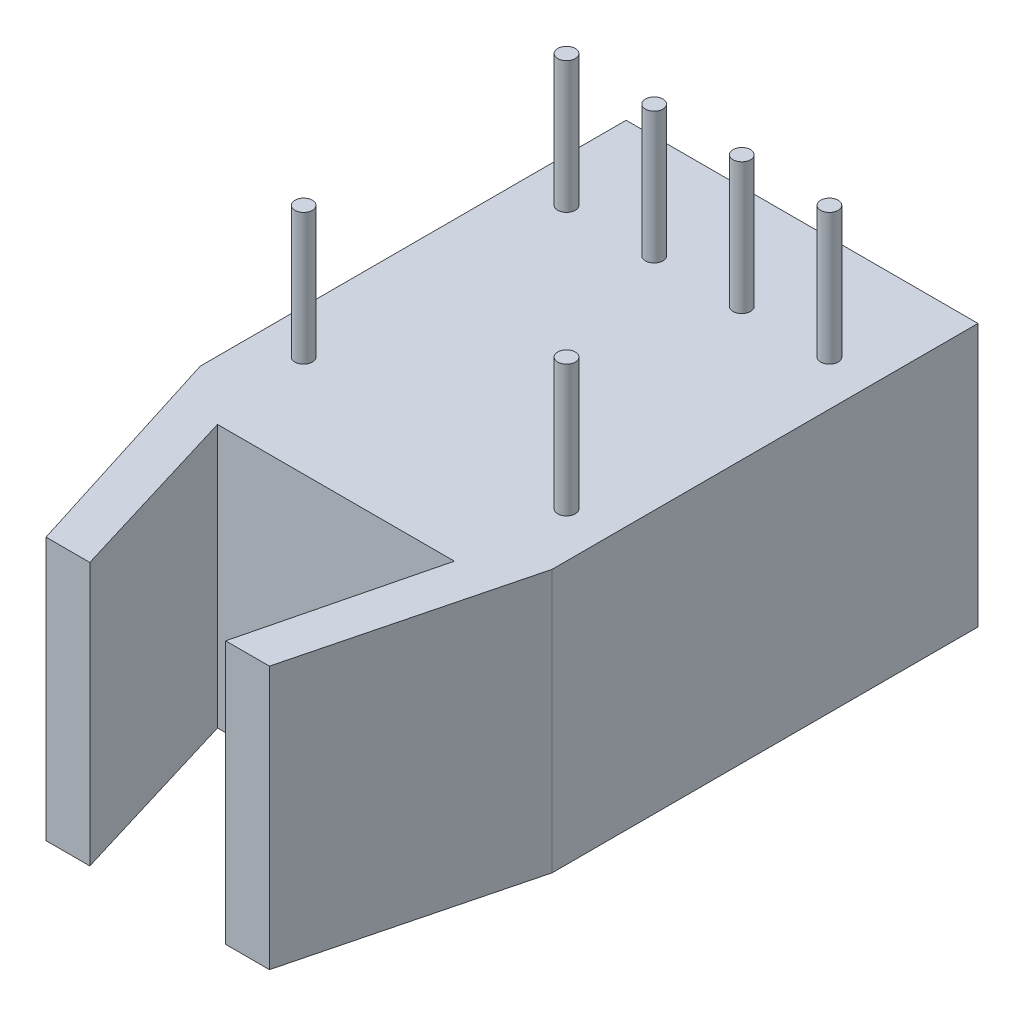
ISO-10303-21;
HEADER;
FILE_DESCRIPTION(('STEP AP214'),'2;1');
FILE_NAME('part.step','',(''),(''),'','','');
FILE_SCHEMA(('AUTOMOTIVE_DESIGN { 1 0 10303 214 1 1 1 1 }'));
ENDSEC;
DATA;
#1=APPLICATION_CONTEXT('core data for automotive mechanical design processes');
#2=APPLICATION_PROTOCOL_DEFINITION('international standard','automotive_design',2000,#1);
#3=PRODUCT_CONTEXT('',#1,'mechanical');
#4=PRODUCT('Part','Part','',(#3));
#5=PRODUCT_RELATED_PRODUCT_CATEGORY('part','',(#4));
#6=PRODUCT_DEFINITION_FORMATION('','',#4);
#7=PRODUCT_DEFINITION_CONTEXT('part definition',#1,'design');
#8=PRODUCT_DEFINITION('design','',#6,#7);
#9=PRODUCT_DEFINITION_SHAPE('','',#8);
#10=(LENGTH_UNIT() NAMED_UNIT(*) SI_UNIT(.MILLI.,.METRE.));
#11=(NAMED_UNIT(*) PLANE_ANGLE_UNIT() SI_UNIT($,.RADIAN.));
#12=(NAMED_UNIT(*) SI_UNIT($,.STERADIAN.) SOLID_ANGLE_UNIT());
#13=UNCERTAINTY_MEASURE_WITH_UNIT(LENGTH_MEASURE(1.E-05),#10,'distance_accuracy_value','');
#14=(GEOMETRIC_REPRESENTATION_CONTEXT(3) GLOBAL_UNCERTAINTY_ASSIGNED_CONTEXT((#13)) GLOBAL_UNIT_ASSIGNED_CONTEXT((#10,
#11,#12)) REPRESENTATION_CONTEXT('',''));
#15=CARTESIAN_POINT('',(0.,0.,0.));
#16=DIRECTION('',(0.,0.,1.));
#17=DIRECTION('',(1.,0.,0.));
#18=AXIS2_PLACEMENT_3D('',#15,#16,#17);
#19=CARTESIAN_POINT('',(0.,7.62,0.));
#20=DIRECTION('',(0.,1.,0.));
#21=DIRECTION('',(0.,0.,1.));
#22=AXIS2_PLACEMENT_3D('',#19,#20,#21);
#23=PLANE('',#22);
#24=CARTESIAN_POINT('',(1.27,7.62,2.9972));
#25=DIRECTION('',(0.,1.,0.));
#26=DIRECTION('',(0.,0.,1.));
#27=AXIS2_PLACEMENT_3D('',#24,#25,#26);
#28=CIRCLE('',#27,0.254);
#29=CARTESIAN_POINT('',(1.27,7.62,3.2512));
#30=VERTEX_POINT('',#29);
#31=EDGE_CURVE('E135',#30,#30,#28,.T.);
#32=ORIENTED_EDGE('',*,*,#31,.F.);
#33=EDGE_LOOP('',(#32));
#34=FACE_BOUND('',#33,.T.);
#35=DIRECTION('',(0.,0.,1.));
#36=VECTOR('',#35,1.);
#37=CARTESIAN_POINT('',(0.,7.62,0.));
#38=LINE('',#37,#36);
#39=CARTESIAN_POINT('',(0.,7.62,0.));
#40=VERTEX_POINT('',#39);
#41=CARTESIAN_POINT('',(0.,7.62,12.3444));
#42=VERTEX_POINT('',#41);
#43=EDGE_CURVE('E130',#40,#42,#38,.T.);
#44=ORIENTED_EDGE('',*,*,#43,.T.);
#45=DIRECTION('',(0.300509046787398,0.,0.953778964330274));
#46=VECTOR('',#45,1.);
#47=CARTESIAN_POINT('',(0.,7.62,12.3444));
#48=LINE('',#47,#46);
#49=CARTESIAN_POINT('',(2.05672700801933,7.62,18.8722));
#50=VERTEX_POINT('',#49);
#51=EDGE_CURVE('E112',#42,#50,#48,.T.);
#52=ORIENTED_EDGE('',*,*,#51,.T.);
#53=DIRECTION('',(1.,0.,0.));
#54=VECTOR('',#53,1.);
#55=CARTESIAN_POINT('',(2.05672700801933,7.62,18.8722));
#56=LINE('',#55,#54);
#57=CARTESIAN_POINT('',(3.32672700801933,7.62,18.8722));
#58=VERTEX_POINT('',#57);
#59=EDGE_CURVE('E122',#50,#58,#56,.T.);
#60=ORIENTED_EDGE('',*,*,#59,.T.);
#61=DIRECTION('',(-0.290411816615932,0.,-0.95690175920511));
#62=VECTOR('',#61,1.);
#63=CARTESIAN_POINT('',(3.32672700801933,7.62,18.8722));
#64=LINE('',#63,#62);
#65=CARTESIAN_POINT('',(1.71375929008197,7.62,13.5575001202891));
#66=VERTEX_POINT('',#65);
#67=EDGE_CURVE('E126',#58,#66,#64,.T.);
#68=ORIENTED_EDGE('',*,*,#67,.T.);
#69=DIRECTION('',(1.,0.,0.));
#70=VECTOR('',#69,1.);
#71=CARTESIAN_POINT('',(1.71375929008197,7.62,13.5575001202891));
#72=LINE('',#71,#70);
#73=CARTESIAN_POINT('',(8.57962491547872,7.62,13.5575001202891));
#74=VERTEX_POINT('',#73);
#75=EDGE_CURVE('E140',#66,#74,#72,.T.);
#76=ORIENTED_EDGE('',*,*,#75,.T.);
#77=DIRECTION('',(-0.240338643663703,0.,0.970689103864822));
#78=VECTOR('',#77,1.);
#79=CARTESIAN_POINT('',(8.57962491547872,7.62,13.5575001202891));
#80=LINE('',#79,#78);
#81=CARTESIAN_POINT('',(7.26372700801933,7.62,18.8722));
#82=VERTEX_POINT('',#81);
#83=EDGE_CURVE('E143',#74,#82,#80,.T.);
#84=ORIENTED_EDGE('',*,*,#83,.T.);
#85=DIRECTION('',(1.,0.,0.));
#86=VECTOR('',#85,1.);
#87=CARTESIAN_POINT('',(7.26372700801933,7.62,18.8722));
#88=LINE('',#87,#86);
#89=CARTESIAN_POINT('',(8.53372700801933,7.62,18.8722));
#90=VERTEX_POINT('',#89);
#91=EDGE_CURVE('E146',#82,#90,#88,.T.);
#92=ORIENTED_EDGE('',*,*,#91,.T.);
#93=DIRECTION('',(0.247327596518511,0.,-0.968931917113053));
#94=VECTOR('',#93,1.);
#95=CARTESIAN_POINT('',(8.53372700801933,7.62,18.8722));
#96=LINE('',#95,#94);
#97=CARTESIAN_POINT('',(10.2,7.62,12.3444));
#98=VERTEX_POINT('',#97);
#99=EDGE_CURVE('E149',#90,#98,#96,.T.);
#100=ORIENTED_EDGE('',*,*,#99,.T.);
#101=DIRECTION('',(0.,0.,-1.));
#102=VECTOR('',#101,1.);
#103=CARTESIAN_POINT('',(10.2,7.62,0.));
#104=LINE('',#103,#102);
#105=CARTESIAN_POINT('',(10.2,7.62,0.));
#106=VERTEX_POINT('',#105);
#107=EDGE_CURVE('E51',#98,#106,#104,.T.);
#108=ORIENTED_EDGE('',*,*,#107,.T.);
#109=DIRECTION('',(-1.,0.,0.));
#110=VECTOR('',#109,1.);
#111=CARTESIAN_POINT('',(0.,7.62,0.));
#112=LINE('',#111,#110);
#113=EDGE_CURVE('E46',#106,#40,#112,.T.);
#114=ORIENTED_EDGE('',*,*,#113,.T.);
#115=EDGE_LOOP('',(#44,#52,#60,#68,#76,#84,#92,#100,#108,#114));
#116=FACE_BOUND('',#115,.T.);
#117=CARTESIAN_POINT('',(3.81,7.62,2.9972));
#118=DIRECTION('',(0.,1.,0.));
#119=DIRECTION('',(0.,0.,1.));
#120=AXIS2_PLACEMENT_3D('',#117,#118,#119);
#121=CIRCLE('',#120,0.254);
#122=CARTESIAN_POINT('',(3.81,7.62,3.2512));
#123=VERTEX_POINT('',#122);
#124=EDGE_CURVE('E475',#123,#123,#121,.T.);
#125=ORIENTED_EDGE('',*,*,#124,.F.);
#126=EDGE_LOOP('',(#125));
#127=FACE_BOUND('',#126,.T.);
#128=CARTESIAN_POINT('',(6.35,7.62,2.9972));
#129=DIRECTION('',(0.,1.,0.));
#130=DIRECTION('',(0.,0.,1.));
#131=AXIS2_PLACEMENT_3D('',#128,#129,#130);
#132=CIRCLE('',#131,0.254);
#133=CARTESIAN_POINT('',(6.35,7.62,3.2512));
#134=VERTEX_POINT('',#133);
#135=EDGE_CURVE('E196',#134,#134,#132,.T.);
#136=ORIENTED_EDGE('',*,*,#135,.F.);
#137=EDGE_LOOP('',(#136));
#138=FACE_BOUND('',#137,.T.);
#139=CARTESIAN_POINT('',(8.89,7.62,2.9972));
#140=DIRECTION('',(0.,1.,0.));
#141=DIRECTION('',(0.,0.,1.));
#142=AXIS2_PLACEMENT_3D('',#139,#140,#141);
#143=CIRCLE('',#142,0.254);
#144=CARTESIAN_POINT('',(8.89,7.62,3.2512));
#145=VERTEX_POINT('',#144);
#146=EDGE_CURVE('E202',#145,#145,#143,.T.);
#147=ORIENTED_EDGE('',*,*,#146,.F.);
#148=EDGE_LOOP('',(#147));
#149=FACE_BOUND('',#148,.T.);
#150=CARTESIAN_POINT('',(1.27,7.62,10.6172));
#151=DIRECTION('',(0.,1.,0.));
#152=DIRECTION('',(0.,0.,1.));
#153=AXIS2_PLACEMENT_3D('',#150,#151,#152);
#154=CIRCLE('',#153,0.254);
#155=CARTESIAN_POINT('',(1.27,7.62,10.8712));
#156=VERTEX_POINT('',#155);
#157=EDGE_CURVE('E208',#156,#156,#154,.T.);
#158=ORIENTED_EDGE('',*,*,#157,.F.);
#159=EDGE_LOOP('',(#158));
#160=FACE_BOUND('',#159,.T.);
#161=CARTESIAN_POINT('',(8.89,7.62,10.6172));
#162=DIRECTION('',(0.,1.,0.));
#163=DIRECTION('',(0.,0.,1.));
#164=AXIS2_PLACEMENT_3D('',#161,#162,#163);
#165=CIRCLE('',#164,0.254);
#166=CARTESIAN_POINT('',(8.89,7.62,10.8712));
#167=VERTEX_POINT('',#166);
#168=EDGE_CURVE('E39',#167,#167,#165,.T.);
#169=ORIENTED_EDGE('',*,*,#168,.F.);
#170=EDGE_LOOP('',(#169));
#171=FACE_BOUND('',#170,.T.);
#172=ADVANCED_FACE('F31',(#34,#116,#127,#138,#149,#160,#171),#23,.T.);
#173=CARTESIAN_POINT('',(0.,7.62,0.));
#174=DIRECTION('',(1.,0.,0.));
#175=DIRECTION('',(0.,0.,-1.));
#176=AXIS2_PLACEMENT_3D('',#173,#174,#175);
#177=PLANE('',#176);
#178=DIRECTION('',(0.,0.,1.));
#179=VECTOR('',#178,1.);
#180=CARTESIAN_POINT('',(0.,0.,0.));
#181=LINE('',#180,#179);
#182=CARTESIAN_POINT('',(0.,0.,0.));
#183=VERTEX_POINT('',#182);
#184=CARTESIAN_POINT('',(0.,0.,12.3444));
#185=VERTEX_POINT('',#184);
#186=EDGE_CURVE('E170',#183,#185,#181,.T.);
#187=ORIENTED_EDGE('',*,*,#186,.T.);
#188=DIRECTION('',(0.,-1.,0.));
#189=VECTOR('',#188,1.);
#190=CARTESIAN_POINT('',(0.,7.62,12.3444));
#191=LINE('',#190,#189);
#192=EDGE_CURVE('E194',#42,#185,#191,.T.);
#193=ORIENTED_EDGE('',*,*,#192,.F.);
#194=ORIENTED_EDGE('',*,*,#43,.F.);
#195=DIRECTION('',(0.,-1.,0.));
#196=VECTOR('',#195,1.);
#197=CARTESIAN_POINT('',(0.,7.62,0.));
#198=LINE('',#197,#196);
#199=EDGE_CURVE('E186',#40,#183,#198,.T.);
#200=ORIENTED_EDGE('',*,*,#199,.T.);
#201=EDGE_LOOP('',(#187,#193,#194,#200));
#202=FACE_BOUND('',#201,.T.);
#203=ADVANCED_FACE('F219',(#202),#177,.F.);
#204=CARTESIAN_POINT('',(10.2,7.62,0.));
#205=DIRECTION('',(-1.,0.,0.));
#206=DIRECTION('',(0.,0.,1.));
#207=AXIS2_PLACEMENT_3D('',#204,#205,#206);
#208=PLANE('',#207);
#209=DIRECTION('',(0.,0.,-1.));
#210=VECTOR('',#209,1.);
#211=CARTESIAN_POINT('',(10.2,0.,0.));
#212=LINE('',#211,#210);
#213=CARTESIAN_POINT('',(10.2,0.,12.3444));
#214=VERTEX_POINT('',#213);
#215=CARTESIAN_POINT('',(10.2,0.,0.));
#216=VERTEX_POINT('',#215);
#217=EDGE_CURVE('E179',#214,#216,#212,.T.);
#218=ORIENTED_EDGE('',*,*,#217,.T.);
#219=DIRECTION('',(0.,-1.,0.));
#220=VECTOR('',#219,1.);
#221=CARTESIAN_POINT('',(10.2,7.62,0.));
#222=LINE('',#221,#220);
#223=EDGE_CURVE('E189',#106,#216,#222,.T.);
#224=ORIENTED_EDGE('',*,*,#223,.F.);
#225=ORIENTED_EDGE('',*,*,#107,.F.);
#226=DIRECTION('',(0.,-1.,0.));
#227=VECTOR('',#226,1.);
#228=CARTESIAN_POINT('',(10.2,7.62,12.3444));
#229=LINE('',#228,#227);
#230=EDGE_CURVE('E192',#98,#214,#229,.T.);
#231=ORIENTED_EDGE('',*,*,#230,.T.);
#232=EDGE_LOOP('',(#218,#224,#225,#231));
#233=FACE_BOUND('',#232,.T.);
#234=ADVANCED_FACE('F225',(#233),#208,.F.);
#235=CARTESIAN_POINT('',(0.,7.62,0.));
#236=DIRECTION('',(0.,0.,1.));
#237=DIRECTION('',(1.,0.,0.));
#238=AXIS2_PLACEMENT_3D('',#235,#236,#237);
#239=PLANE('',#238);
#240=DIRECTION('',(-1.,0.,0.));
#241=VECTOR('',#240,1.);
#242=CARTESIAN_POINT('',(0.,0.,0.));
#243=LINE('',#242,#241);
#244=EDGE_CURVE('E181',#216,#183,#243,.T.);
#245=ORIENTED_EDGE('',*,*,#244,.T.);
#246=ORIENTED_EDGE('',*,*,#199,.F.);
#247=ORIENTED_EDGE('',*,*,#113,.F.);
#248=ORIENTED_EDGE('',*,*,#223,.T.);
#249=EDGE_LOOP('',(#245,#246,#247,#248));
#250=FACE_BOUND('',#249,.T.);
#251=ADVANCED_FACE('F233',(#250),#239,.F.);
#252=CARTESIAN_POINT('',(0.,0.,0.));
#253=DIRECTION('',(0.,1.,0.));
#254=DIRECTION('',(0.,0.,1.));
#255=AXIS2_PLACEMENT_3D('',#252,#253,#254);
#256=PLANE('',#255);
#257=ORIENTED_EDGE('',*,*,#186,.F.);
#258=ORIENTED_EDGE('',*,*,#244,.F.);
#259=ORIENTED_EDGE('',*,*,#217,.F.);
#260=DIRECTION('',(0.247327596518511,0.,-0.968931917113053));
#261=VECTOR('',#260,1.);
#262=CARTESIAN_POINT('',(8.53372700801933,0.,18.8722));
#263=LINE('',#262,#261);
#264=CARTESIAN_POINT('',(8.53372700801933,0.,18.8722));
#265=VERTEX_POINT('',#264);
#266=EDGE_CURVE('E119',#265,#214,#263,.T.);
#267=ORIENTED_EDGE('',*,*,#266,.F.);
#268=DIRECTION('',(1.,0.,0.));
#269=VECTOR('',#268,1.);
#270=CARTESIAN_POINT('',(7.26372700801933,0.,18.8722));
#271=LINE('',#270,#269);
#272=CARTESIAN_POINT('',(7.26372700801933,0.,18.8722));
#273=VERTEX_POINT('',#272);
#274=EDGE_CURVE('E163',#273,#265,#271,.T.);
#275=ORIENTED_EDGE('',*,*,#274,.F.);
#276=DIRECTION('',(-0.240338643663703,0.,0.970689103864822));
#277=VECTOR('',#276,1.);
#278=CARTESIAN_POINT('',(8.57962491547872,0.,13.5575001202891));
#279=LINE('',#278,#277);
#280=CARTESIAN_POINT('',(8.57962491547872,0.,13.5575001202891));
#281=VERTEX_POINT('',#280);
#282=EDGE_CURVE('E160',#281,#273,#279,.T.);
#283=ORIENTED_EDGE('',*,*,#282,.F.);
#284=DIRECTION('',(1.,0.,0.));
#285=VECTOR('',#284,1.);
#286=CARTESIAN_POINT('',(1.71375929008197,0.,13.5575001202891));
#287=LINE('',#286,#285);
#288=CARTESIAN_POINT('',(1.71375929008197,0.,13.5575001202891));
#289=VERTEX_POINT('',#288);
#290=EDGE_CURVE('E157',#289,#281,#287,.T.);
#291=ORIENTED_EDGE('',*,*,#290,.F.);
#292=DIRECTION('',(-0.290411816615932,0.,-0.95690175920511));
#293=VECTOR('',#292,1.);
#294=CARTESIAN_POINT('',(3.32672700801933,0.,18.8722));
#295=LINE('',#294,#293);
#296=CARTESIAN_POINT('',(3.32672700801933,0.,18.8722));
#297=VERTEX_POINT('',#296);
#298=EDGE_CURVE('E154',#297,#289,#295,.T.);
#299=ORIENTED_EDGE('',*,*,#298,.F.);
#300=DIRECTION('',(1.,0.,0.));
#301=VECTOR('',#300,1.);
#302=CARTESIAN_POINT('',(2.05672700801933,0.,18.8722));
#303=LINE('',#302,#301);
#304=CARTESIAN_POINT('',(2.05672700801933,0.,18.8722));
#305=VERTEX_POINT('',#304);
#306=EDGE_CURVE('E152',#305,#297,#303,.T.);
#307=ORIENTED_EDGE('',*,*,#306,.F.);
#308=DIRECTION('',(0.300509046787398,0.,0.953778964330274));
#309=VECTOR('',#308,1.);
#310=CARTESIAN_POINT('',(0.,0.,12.3444));
#311=LINE('',#310,#309);
#312=EDGE_CURVE('E114',#185,#305,#311,.T.);
#313=ORIENTED_EDGE('',*,*,#312,.F.);
#314=EDGE_LOOP('',(#257,#258,#259,#267,#275,#283,#291,#299,#307,#313));
#315=FACE_BOUND('',#314,.T.);
#316=ADVANCED_FACE('F231',(#315),#256,.F.);
#317=CARTESIAN_POINT('',(8.53372700801933,0.,18.8722));
#318=DIRECTION('',(0.968931917113053,0.,0.247327596518511));
#319=DIRECTION('',(0.247327596518511,0.,-0.968931917113053));
#320=AXIS2_PLACEMENT_3D('',#317,#318,#319);
#321=PLANE('',#320);
#322=ORIENTED_EDGE('',*,*,#99,.F.);
#323=DIRECTION('',(0.,1.,0.));
#324=VECTOR('',#323,1.);
#325=CARTESIAN_POINT('',(8.53372700801933,0.,18.8722));
#326=LINE('',#325,#324);
#327=EDGE_CURVE('E168',#265,#90,#326,.T.);
#328=ORIENTED_EDGE('',*,*,#327,.F.);
#329=ORIENTED_EDGE('',*,*,#266,.T.);
#330=ORIENTED_EDGE('',*,*,#230,.F.);
#331=EDGE_LOOP('',(#322,#328,#329,#330));
#332=FACE_BOUND('',#331,.T.);
#333=ADVANCED_FACE('F370',(#332),#321,.T.);
#334=CARTESIAN_POINT('',(7.26372700801933,0.,18.8722));
#335=DIRECTION('',(0.,0.,1.));
#336=DIRECTION('',(1.,0.,0.));
#337=AXIS2_PLACEMENT_3D('',#334,#335,#336);
#338=PLANE('',#337);
#339=ORIENTED_EDGE('',*,*,#91,.F.);
#340=DIRECTION('',(0.,1.,0.));
#341=VECTOR('',#340,1.);
#342=CARTESIAN_POINT('',(7.26372700801933,0.,18.8722));
#343=LINE('',#342,#341);
#344=EDGE_CURVE('E171',#273,#82,#343,.T.);
#345=ORIENTED_EDGE('',*,*,#344,.F.);
#346=ORIENTED_EDGE('',*,*,#274,.T.);
#347=ORIENTED_EDGE('',*,*,#327,.T.);
#348=EDGE_LOOP('',(#339,#345,#346,#347));
#349=FACE_BOUND('',#348,.T.);
#350=ADVANCED_FACE('F362',(#349),#338,.T.);
#351=CARTESIAN_POINT('',(8.57962491547872,0.,13.5575001202891));
#352=DIRECTION('',(-0.970689103864822,0.,-0.240338643663703));
#353=DIRECTION('',(-0.240338643663703,0.,0.970689103864822));
#354=AXIS2_PLACEMENT_3D('',#351,#352,#353);
#355=PLANE('',#354);
#356=ORIENTED_EDGE('',*,*,#83,.F.);
#357=DIRECTION('',(0.,1.,0.));
#358=VECTOR('',#357,1.);
#359=CARTESIAN_POINT('',(8.57962491547872,0.,13.5575001202891));
#360=LINE('',#359,#358);
#361=EDGE_CURVE('E173',#281,#74,#360,.T.);
#362=ORIENTED_EDGE('',*,*,#361,.F.);
#363=ORIENTED_EDGE('',*,*,#282,.T.);
#364=ORIENTED_EDGE('',*,*,#344,.T.);
#365=EDGE_LOOP('',(#356,#362,#363,#364));
#366=FACE_BOUND('',#365,.T.);
#367=ADVANCED_FACE('F354',(#366),#355,.T.);
#368=CARTESIAN_POINT('',(1.71375929008197,0.,13.5575001202891));
#369=DIRECTION('',(0.,0.,1.));
#370=DIRECTION('',(1.,0.,0.));
#371=AXIS2_PLACEMENT_3D('',#368,#369,#370);
#372=PLANE('',#371);
#373=ORIENTED_EDGE('',*,*,#75,.F.);
#374=DIRECTION('',(0.,1.,0.));
#375=VECTOR('',#374,1.);
#376=CARTESIAN_POINT('',(1.71375929008197,0.,13.5575001202891));
#377=LINE('',#376,#375);
#378=EDGE_CURVE('E175',#289,#66,#377,.T.);
#379=ORIENTED_EDGE('',*,*,#378,.F.);
#380=ORIENTED_EDGE('',*,*,#290,.T.);
#381=ORIENTED_EDGE('',*,*,#361,.T.);
#382=EDGE_LOOP('',(#373,#379,#380,#381));
#383=FACE_BOUND('',#382,.T.);
#384=ADVANCED_FACE('F346',(#383),#372,.T.);
#385=CARTESIAN_POINT('',(3.32672700801933,0.,18.8722));
#386=DIRECTION('',(0.95690175920511,0.,-0.290411816615932));
#387=DIRECTION('',(-0.290411816615932,0.,-0.95690175920511));
#388=AXIS2_PLACEMENT_3D('',#385,#386,#387);
#389=PLANE('',#388);
#390=ORIENTED_EDGE('',*,*,#67,.F.);
#391=DIRECTION('',(0.,1.,0.));
#392=VECTOR('',#391,1.);
#393=CARTESIAN_POINT('',(3.32672700801933,0.,18.8722));
#394=LINE('',#393,#392);
#395=EDGE_CURVE('E118',#297,#58,#394,.T.);
#396=ORIENTED_EDGE('',*,*,#395,.F.);
#397=ORIENTED_EDGE('',*,*,#298,.T.);
#398=ORIENTED_EDGE('',*,*,#378,.T.);
#399=EDGE_LOOP('',(#390,#396,#397,#398));
#400=FACE_BOUND('',#399,.T.);
#401=ADVANCED_FACE('F339',(#400),#389,.T.);
#402=CARTESIAN_POINT('',(2.05672700801933,0.,18.8722));
#403=DIRECTION('',(0.,0.,1.));
#404=DIRECTION('',(1.,0.,0.));
#405=AXIS2_PLACEMENT_3D('',#402,#403,#404);
#406=PLANE('',#405);
#407=ORIENTED_EDGE('',*,*,#59,.F.);
#408=DIRECTION('',(0.,1.,0.));
#409=VECTOR('',#408,1.);
#410=CARTESIAN_POINT('',(2.05672700801933,0.,18.8722));
#411=LINE('',#410,#409);
#412=EDGE_CURVE('E107',#305,#50,#411,.T.);
#413=ORIENTED_EDGE('',*,*,#412,.F.);
#414=ORIENTED_EDGE('',*,*,#306,.T.);
#415=ORIENTED_EDGE('',*,*,#395,.T.);
#416=EDGE_LOOP('',(#407,#413,#414,#415));
#417=FACE_BOUND('',#416,.T.);
#418=ADVANCED_FACE('F123',(#417),#406,.T.);
#419=CARTESIAN_POINT('',(0.,0.,12.3444));
#420=DIRECTION('',(-0.953778964330274,0.,0.300509046787398));
#421=DIRECTION('',(0.300509046787398,0.,0.953778964330274));
#422=AXIS2_PLACEMENT_3D('',#419,#420,#421);
#423=PLANE('',#422);
#424=ORIENTED_EDGE('',*,*,#51,.F.);
#425=ORIENTED_EDGE('',*,*,#192,.T.);
#426=ORIENTED_EDGE('',*,*,#312,.T.);
#427=ORIENTED_EDGE('',*,*,#412,.T.);
#428=EDGE_LOOP('',(#424,#425,#426,#427));
#429=FACE_BOUND('',#428,.T.);
#430=ADVANCED_FACE('F109',(#429),#423,.T.);
#431=CARTESIAN_POINT('',(1.27,11.43,2.9972));
#432=DIRECTION('',(0.,-1.,0.));
#433=DIRECTION('',(0.,0.,-1.));
#434=AXIS2_PLACEMENT_3D('',#431,#432,#433);
#435=CYLINDRICAL_SURFACE('',#434,0.254);
#436=CARTESIAN_POINT('',(1.27,11.43,2.9972));
#437=DIRECTION('',(0.,1.,0.));
#438=DIRECTION('',(0.,0.,1.));
#439=AXIS2_PLACEMENT_3D('',#436,#437,#438);
#440=CIRCLE('',#439,0.254);
#441=CARTESIAN_POINT('',(1.27,11.43,3.2512));
#442=VERTEX_POINT('',#441);
#443=EDGE_CURVE('E132',#442,#442,#440,.T.);
#444=ORIENTED_EDGE('',*,*,#443,.F.);
#445=EDGE_LOOP('',(#444));
#446=FACE_BOUND('',#445,.T.);
#447=ORIENTED_EDGE('',*,*,#31,.T.);
#448=EDGE_LOOP('',(#447));
#449=FACE_BOUND('',#448,.T.);
#450=ADVANCED_FACE('F319',(#446,#449),#435,.T.);
#451=CARTESIAN_POINT('',(1.27,11.43,2.9972));
#452=DIRECTION('',(0.,1.,0.));
#453=DIRECTION('',(0.,0.,1.));
#454=AXIS2_PLACEMENT_3D('',#451,#452,#453);
#455=PLANE('',#454);
#456=ORIENTED_EDGE('',*,*,#443,.T.);
#457=EDGE_LOOP('',(#456));
#458=FACE_BOUND('',#457,.T.);
#459=ADVANCED_FACE('F306',(#458),#455,.T.);
#460=CARTESIAN_POINT('',(3.81,11.43,2.9972));
#461=DIRECTION('',(0.,-1.,0.));
#462=DIRECTION('',(0.,0.,-1.));
#463=AXIS2_PLACEMENT_3D('',#460,#461,#462);
#464=CYLINDRICAL_SURFACE('',#463,0.254);
#465=CARTESIAN_POINT('',(3.81,11.43,2.9972));
#466=DIRECTION('',(0.,1.,0.));
#467=DIRECTION('',(0.,0.,1.));
#468=AXIS2_PLACEMENT_3D('',#465,#466,#467);
#469=CIRCLE('',#468,0.254);
#470=CARTESIAN_POINT('',(3.81,11.43,3.2512));
#471=VERTEX_POINT('',#470);
#472=EDGE_CURVE('E473',#471,#471,#469,.T.);
#473=ORIENTED_EDGE('',*,*,#472,.F.);
#474=EDGE_LOOP('',(#473));
#475=FACE_BOUND('',#474,.T.);
#476=ORIENTED_EDGE('',*,*,#124,.T.);
#477=EDGE_LOOP('',(#476));
#478=FACE_BOUND('',#477,.T.);
#479=ADVANCED_FACE('F250',(#475,#478),#464,.T.);
#480=CARTESIAN_POINT('',(3.81,11.43,2.9972));
#481=DIRECTION('',(0.,1.,0.));
#482=DIRECTION('',(0.,0.,1.));
#483=AXIS2_PLACEMENT_3D('',#480,#481,#482);
#484=PLANE('',#483);
#485=ORIENTED_EDGE('',*,*,#472,.T.);
#486=EDGE_LOOP('',(#485));
#487=FACE_BOUND('',#486,.T.);
#488=ADVANCED_FACE('F248',(#487),#484,.T.);
#489=CARTESIAN_POINT('',(6.35,11.43,2.9972));
#490=DIRECTION('',(0.,1.,0.));
#491=DIRECTION('',(0.,0.,1.));
#492=AXIS2_PLACEMENT_3D('',#489,#490,#491);
#493=PLANE('',#492);
#494=CARTESIAN_POINT('',(6.35,11.43,2.9972));
#495=DIRECTION('',(0.,1.,0.));
#496=DIRECTION('',(0.,0.,1.));
#497=AXIS2_PLACEMENT_3D('',#494,#495,#496);
#498=CIRCLE('',#497,0.254);
#499=CARTESIAN_POINT('',(6.35,11.43,3.2512));
#500=VERTEX_POINT('',#499);
#501=EDGE_CURVE('E199',#500,#500,#498,.T.);
#502=ORIENTED_EDGE('',*,*,#501,.T.);
#503=EDGE_LOOP('',(#502));
#504=FACE_BOUND('',#503,.T.);
#505=ADVANCED_FACE('F244',(#504),#493,.T.);
#506=CARTESIAN_POINT('',(6.35,11.43,2.9972));
#507=DIRECTION('',(0.,-1.,0.));
#508=DIRECTION('',(0.,0.,-1.));
#509=AXIS2_PLACEMENT_3D('',#506,#507,#508);
#510=CYLINDRICAL_SURFACE('',#509,0.254);
#511=ORIENTED_EDGE('',*,*,#501,.F.);
#512=EDGE_LOOP('',(#511));
#513=FACE_BOUND('',#512,.T.);
#514=ORIENTED_EDGE('',*,*,#135,.T.);
#515=EDGE_LOOP('',(#514));
#516=FACE_BOUND('',#515,.T.);
#517=ADVANCED_FACE('F240',(#513,#516),#510,.T.);
#518=CARTESIAN_POINT('',(8.89,11.43,2.9972));
#519=DIRECTION('',(0.,1.,0.));
#520=DIRECTION('',(0.,0.,1.));
#521=AXIS2_PLACEMENT_3D('',#518,#519,#520);
#522=PLANE('',#521);
#523=CARTESIAN_POINT('',(8.89,11.43,2.9972));
#524=DIRECTION('',(0.,1.,0.));
#525=DIRECTION('',(0.,0.,1.));
#526=AXIS2_PLACEMENT_3D('',#523,#524,#525);
#527=CIRCLE('',#526,0.254);
#528=CARTESIAN_POINT('',(8.89,11.43,3.2512));
#529=VERTEX_POINT('',#528);
#530=EDGE_CURVE('E205',#529,#529,#527,.T.);
#531=ORIENTED_EDGE('',*,*,#530,.T.);
#532=EDGE_LOOP('',(#531));
#533=FACE_BOUND('',#532,.T.);
#534=ADVANCED_FACE('F243',(#533),#522,.T.);
#535=CARTESIAN_POINT('',(8.89,11.43,2.9972));
#536=DIRECTION('',(0.,-1.,0.));
#537=DIRECTION('',(0.,0.,-1.));
#538=AXIS2_PLACEMENT_3D('',#535,#536,#537);
#539=CYLINDRICAL_SURFACE('',#538,0.254);
#540=ORIENTED_EDGE('',*,*,#530,.F.);
#541=EDGE_LOOP('',(#540));
#542=FACE_BOUND('',#541,.T.);
#543=ORIENTED_EDGE('',*,*,#146,.T.);
#544=EDGE_LOOP('',(#543));
#545=FACE_BOUND('',#544,.T.);
#546=ADVANCED_FACE('F251',(#542,#545),#539,.T.);
#547=CARTESIAN_POINT('',(1.27,11.43,10.6172));
#548=DIRECTION('',(0.,1.,0.));
#549=DIRECTION('',(0.,0.,1.));
#550=AXIS2_PLACEMENT_3D('',#547,#548,#549);
#551=PLANE('',#550);
#552=CARTESIAN_POINT('',(1.27,11.43,10.6172));
#553=DIRECTION('',(0.,1.,0.));
#554=DIRECTION('',(0.,0.,1.));
#555=AXIS2_PLACEMENT_3D('',#552,#553,#554);
#556=CIRCLE('',#555,0.254);
#557=CARTESIAN_POINT('',(1.27,11.43,10.8712));
#558=VERTEX_POINT('',#557);
#559=EDGE_CURVE('E211',#558,#558,#556,.T.);
#560=ORIENTED_EDGE('',*,*,#559,.T.);
#561=EDGE_LOOP('',(#560));
#562=FACE_BOUND('',#561,.T.);
#563=ADVANCED_FACE('F254',(#562),#551,.T.);
#564=CARTESIAN_POINT('',(1.27,11.43,10.6172));
#565=DIRECTION('',(0.,-1.,0.));
#566=DIRECTION('',(0.,0.,-1.));
#567=AXIS2_PLACEMENT_3D('',#564,#565,#566);
#568=CYLINDRICAL_SURFACE('',#567,0.254);
#569=ORIENTED_EDGE('',*,*,#559,.F.);
#570=EDGE_LOOP('',(#569));
#571=FACE_BOUND('',#570,.T.);
#572=ORIENTED_EDGE('',*,*,#157,.T.);
#573=EDGE_LOOP('',(#572));
#574=FACE_BOUND('',#573,.T.);
#575=ADVANCED_FACE('F259',(#571,#574),#568,.T.);
#576=CARTESIAN_POINT('',(8.89,11.43,10.6172));
#577=DIRECTION('',(0.,1.,0.));
#578=DIRECTION('',(0.,0.,1.));
#579=AXIS2_PLACEMENT_3D('',#576,#577,#578);
#580=PLANE('',#579);
#581=CARTESIAN_POINT('',(8.89,11.43,10.6172));
#582=DIRECTION('',(0.,1.,0.));
#583=DIRECTION('',(0.,0.,1.));
#584=AXIS2_PLACEMENT_3D('',#581,#582,#583);
#585=CIRCLE('',#584,0.254);
#586=CARTESIAN_POINT('',(8.89,11.43,10.8712));
#587=VERTEX_POINT('',#586);
#588=EDGE_CURVE('E11',#587,#587,#585,.T.);
#589=ORIENTED_EDGE('',*,*,#588,.T.);
#590=EDGE_LOOP('',(#589));
#591=FACE_BOUND('',#590,.T.);
#592=ADVANCED_FACE('F33',(#591),#580,.T.);
#593=CARTESIAN_POINT('',(8.89,11.43,10.6172));
#594=DIRECTION('',(0.,-1.,0.));
#595=DIRECTION('',(0.,0.,-1.));
#596=AXIS2_PLACEMENT_3D('',#593,#594,#595);
#597=CYLINDRICAL_SURFACE('',#596,0.254);
#598=ORIENTED_EDGE('',*,*,#588,.F.);
#599=EDGE_LOOP('',(#598));
#600=FACE_BOUND('',#599,.T.);
#601=ORIENTED_EDGE('',*,*,#168,.T.);
#602=EDGE_LOOP('',(#601));
#603=FACE_BOUND('',#602,.T.);
#604=ADVANCED_FACE('F216',(#600,#603),#597,.T.);
#605=CLOSED_SHELL('',(#172,#203,#234,#251,#316,#333,#350,#367,#384,#401,#418,#430,#450,#459,
#479,#488,#505,#517,#534,#546,#563,#575,#592,#604));
#606=MANIFOLD_SOLID_BREP('B2',#605);
#607=ADVANCED_BREP_SHAPE_REPRESENTATION('',(#18,#606),#14);
#608=SHAPE_DEFINITION_REPRESENTATION(#9,#607);
ENDSEC;
END-ISO-10303-21;
